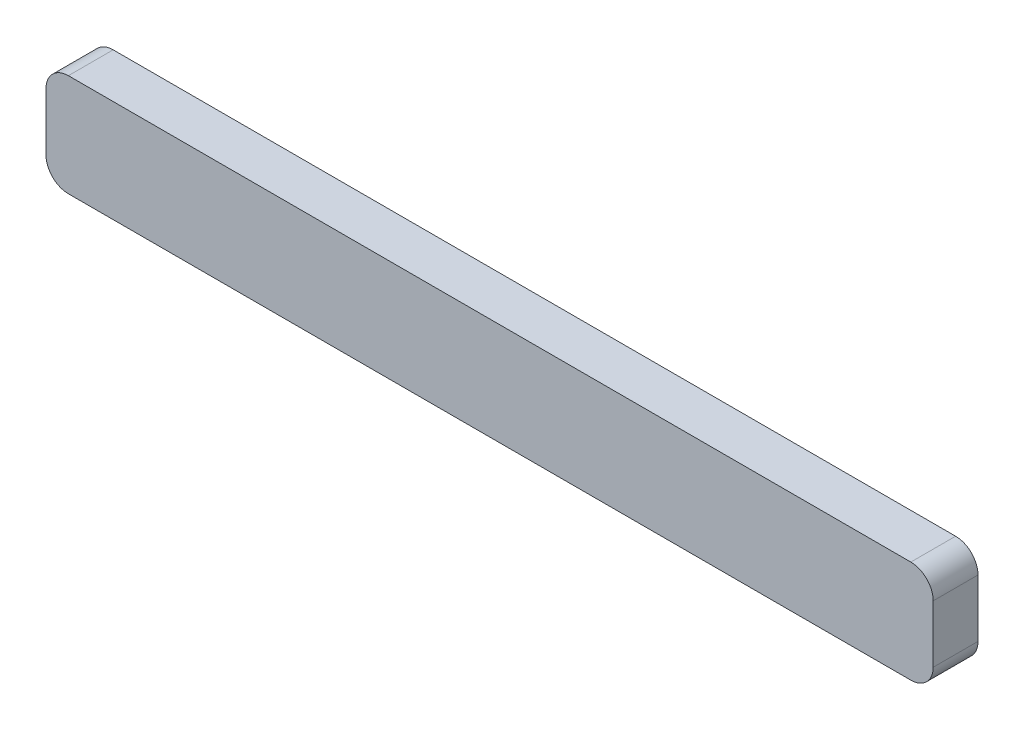
ISO-10303-21;
HEADER;
FILE_DESCRIPTION(('STEP AP214'),'2;1');
FILE_NAME('part.step','',(''),(''),'','','');
FILE_SCHEMA(('AUTOMOTIVE_DESIGN { 1 0 10303 214 1 1 1 1 }'));
ENDSEC;
DATA;
#1=APPLICATION_CONTEXT('core data for automotive mechanical design processes');
#2=APPLICATION_PROTOCOL_DEFINITION('international standard','automotive_design',2000,#1);
#3=PRODUCT_CONTEXT('',#1,'mechanical');
#4=PRODUCT('Part','Part','',(#3));
#5=PRODUCT_RELATED_PRODUCT_CATEGORY('part','',(#4));
#6=PRODUCT_DEFINITION_FORMATION('','',#4);
#7=PRODUCT_DEFINITION_CONTEXT('part definition',#1,'design');
#8=PRODUCT_DEFINITION('design','',#6,#7);
#9=PRODUCT_DEFINITION_SHAPE('','',#8);
#10=(LENGTH_UNIT() NAMED_UNIT(*) SI_UNIT(.MILLI.,.METRE.));
#11=(NAMED_UNIT(*) PLANE_ANGLE_UNIT() SI_UNIT($,.RADIAN.));
#12=(NAMED_UNIT(*) SI_UNIT($,.STERADIAN.) SOLID_ANGLE_UNIT());
#13=UNCERTAINTY_MEASURE_WITH_UNIT(LENGTH_MEASURE(1.E-05),#10,'distance_accuracy_value','');
#14=(GEOMETRIC_REPRESENTATION_CONTEXT(3) GLOBAL_UNCERTAINTY_ASSIGNED_CONTEXT((#13)) GLOBAL_UNIT_ASSIGNED_CONTEXT((#10,
#11,#12)) REPRESENTATION_CONTEXT('',''));
#15=CARTESIAN_POINT('',(0.,0.,0.));
#16=DIRECTION('',(0.,0.,1.));
#17=DIRECTION('',(1.,0.,0.));
#18=AXIS2_PLACEMENT_3D('',#15,#16,#17);
#19=CARTESIAN_POINT('',(-0.645559794709651,1.78285966548645,0.));
#20=DIRECTION('',(0.,0.,1.));
#21=DIRECTION('',(-0.707106781186548,0.707106781186548,0.));
#22=AXIS2_PLACEMENT_3D('',#19,#20,#21);
#23=CYLINDRICAL_SURFACE('',#22,0.05);
#24=CARTESIAN_POINT('',(-0.645559794709651,1.78285966548645,0.1));
#25=DIRECTION('',(0.,0.,-1.));
#26=DIRECTION('',(-1.,0.,0.));
#27=AXIS2_PLACEMENT_3D('',#24,#25,#26);
#28=CIRCLE('',#27,0.05);
#29=CARTESIAN_POINT('',(-0.695559794709651,1.78285966548645,0.1));
#30=VERTEX_POINT('',#29);
#31=CARTESIAN_POINT('',(-0.645559794709651,1.83285966548645,0.1));
#32=VERTEX_POINT('',#31);
#33=EDGE_CURVE('E11',#30,#32,#28,.T.);
#34=ORIENTED_EDGE('',*,*,#33,.T.);
#35=DIRECTION('',(0.,0.,-1.));
#36=VECTOR('',#35,1.);
#37=CARTESIAN_POINT('',(-0.645559794709651,1.83285966548645,0.1));
#38=LINE('',#37,#36);
#39=CARTESIAN_POINT('',(-0.645559794709651,1.83285966548645,0.));
#40=VERTEX_POINT('',#39);
#41=EDGE_CURVE('E145',#32,#40,#38,.T.);
#42=ORIENTED_EDGE('',*,*,#41,.T.);
#43=CARTESIAN_POINT('',(-0.645559794709651,1.78285966548645,0.));
#44=DIRECTION('',(0.,0.,1.));
#45=DIRECTION('',(0.,1.,0.));
#46=AXIS2_PLACEMENT_3D('',#43,#44,#45);
#47=CIRCLE('',#46,0.05);
#48=CARTESIAN_POINT('',(-0.695559794709651,1.78285966548645,0.));
#49=VERTEX_POINT('',#48);
#50=EDGE_CURVE('E143',#40,#49,#47,.T.);
#51=ORIENTED_EDGE('',*,*,#50,.T.);
#52=DIRECTION('',(0.,0.,1.));
#53=VECTOR('',#52,1.);
#54=CARTESIAN_POINT('',(-0.695559794709651,1.78285966548645,0.));
#55=LINE('',#54,#53);
#56=EDGE_CURVE('E24',#49,#30,#55,.T.);
#57=ORIENTED_EDGE('',*,*,#56,.T.);
#58=EDGE_LOOP('',(#34,#42,#51,#57));
#59=FACE_BOUND('',#58,.T.);
#60=ADVANCED_FACE('F17',(#59),#23,.T.);
#61=CARTESIAN_POINT('',(-0.695559794709651,1.83285966548645,0.));
#62=DIRECTION('',(-1.,0.,0.));
#63=DIRECTION('',(0.,-1.,0.));
#64=AXIS2_PLACEMENT_3D('',#61,#62,#63);
#65=PLANE('',#64);
#66=ORIENTED_EDGE('',*,*,#56,.F.);
#67=DIRECTION('',(0.,1.,0.));
#68=VECTOR('',#67,1.);
#69=CARTESIAN_POINT('',(-0.695559794709651,1.65443157862083,0.));
#70=LINE('',#69,#68);
#71=CARTESIAN_POINT('',(-0.695559794709651,1.65443157862083,0.));
#72=VERTEX_POINT('',#71);
#73=EDGE_CURVE('E140',#72,#49,#70,.T.);
#74=ORIENTED_EDGE('',*,*,#73,.F.);
#75=DIRECTION('',(0.,0.,-1.));
#76=VECTOR('',#75,1.);
#77=CARTESIAN_POINT('',(-0.695559794709651,1.65443157862083,0.1));
#78=LINE('',#77,#76);
#79=CARTESIAN_POINT('',(-0.695559794709651,1.65443157862083,0.1));
#80=VERTEX_POINT('',#79);
#81=EDGE_CURVE('E133',#80,#72,#78,.T.);
#82=ORIENTED_EDGE('',*,*,#81,.F.);
#83=DIRECTION('',(0.,-1.,0.));
#84=VECTOR('',#83,1.);
#85=CARTESIAN_POINT('',(-0.695559794709651,1.78285966548645,0.1));
#86=LINE('',#85,#84);
#87=EDGE_CURVE('E125',#30,#80,#86,.T.);
#88=ORIENTED_EDGE('',*,*,#87,.F.);
#89=EDGE_LOOP('',(#66,#74,#82,#88));
#90=FACE_BOUND('',#89,.T.);
#91=ADVANCED_FACE('F148',(#90),#65,.T.);
#92=CARTESIAN_POINT('',(0.294995501272643,1.71864562205364,0.));
#93=DIRECTION('',(0.,0.,1.));
#94=DIRECTION('',(1.,0.,0.));
#95=AXIS2_PLACEMENT_3D('',#92,#93,#94);
#96=PLANE('',#95);
#97=ORIENTED_EDGE('',*,*,#50,.F.);
#98=DIRECTION('',(1.,0.,0.));
#99=VECTOR('',#98,1.);
#100=CARTESIAN_POINT('',(-0.645559794709651,1.83285966548645,0.));
#101=LINE('',#100,#99);
#102=CARTESIAN_POINT('',(1.23555079725494,1.83285966548645,0.));
#103=VERTEX_POINT('',#102);
#104=EDGE_CURVE('E136',#40,#103,#101,.T.);
#105=ORIENTED_EDGE('',*,*,#104,.T.);
#106=CARTESIAN_POINT('',(1.23555079725494,1.78285966548645,0.));
#107=DIRECTION('',(0.,0.,1.));
#108=DIRECTION('',(1.,0.,0.));
#109=AXIS2_PLACEMENT_3D('',#106,#107,#108);
#110=CIRCLE('',#109,0.05);
#111=CARTESIAN_POINT('',(1.28555079725494,1.78285966548645,0.));
#112=VERTEX_POINT('',#111);
#113=EDGE_CURVE('E128',#112,#103,#110,.T.);
#114=ORIENTED_EDGE('',*,*,#113,.F.);
#115=DIRECTION('',(0.,-1.,0.));
#116=VECTOR('',#115,1.);
#117=CARTESIAN_POINT('',(1.28555079725494,1.78285966548645,0.));
#118=LINE('',#117,#116);
#119=CARTESIAN_POINT('',(1.28555079725494,1.65443157862083,0.));
#120=VERTEX_POINT('',#119);
#121=EDGE_CURVE('E115',#112,#120,#118,.T.);
#122=ORIENTED_EDGE('',*,*,#121,.T.);
#123=CARTESIAN_POINT('',(1.23555079725494,1.65443157862083,0.));
#124=DIRECTION('',(0.,0.,1.));
#125=DIRECTION('',(0.,-1.,0.));
#126=AXIS2_PLACEMENT_3D('',#123,#124,#125);
#127=CIRCLE('',#126,0.05);
#128=CARTESIAN_POINT('',(1.23555079725494,1.60443157862083,0.));
#129=VERTEX_POINT('',#128);
#130=EDGE_CURVE('E99',#129,#120,#127,.T.);
#131=ORIENTED_EDGE('',*,*,#130,.F.);
#132=DIRECTION('',(-1.,0.,0.));
#133=VECTOR('',#132,1.);
#134=CARTESIAN_POINT('',(1.23555079725494,1.60443157862083,0.));
#135=LINE('',#134,#133);
#136=CARTESIAN_POINT('',(-0.645559794709651,1.60443157862083,0.));
#137=VERTEX_POINT('',#136);
#138=EDGE_CURVE('E120',#129,#137,#135,.T.);
#139=ORIENTED_EDGE('',*,*,#138,.T.);
#140=CARTESIAN_POINT('',(-0.645559794709651,1.65443157862083,0.));
#141=DIRECTION('',(0.,0.,1.));
#142=DIRECTION('',(-1.,0.,0.));
#143=AXIS2_PLACEMENT_3D('',#140,#141,#142);
#144=CIRCLE('',#143,0.05);
#145=EDGE_CURVE('E117',#72,#137,#144,.T.);
#146=ORIENTED_EDGE('',*,*,#145,.F.);
#147=ORIENTED_EDGE('',*,*,#73,.T.);
#148=EDGE_LOOP('',(#97,#105,#114,#122,#131,#139,#146,#147));
#149=FACE_BOUND('',#148,.T.);
#150=ADVANCED_FACE('F158',(#149),#96,.F.);
#151=CARTESIAN_POINT('',(-0.645559794709651,1.65443157862083,0.));
#152=DIRECTION('',(0.,0.,1.));
#153=DIRECTION('',(-0.707106781186548,-0.707106781186548,0.));
#154=AXIS2_PLACEMENT_3D('',#151,#152,#153);
#155=CYLINDRICAL_SURFACE('',#154,0.05);
#156=CARTESIAN_POINT('',(-0.645559794709651,1.65443157862083,0.1));
#157=DIRECTION('',(0.,0.,-1.));
#158=DIRECTION('',(0.,-1.,0.));
#159=AXIS2_PLACEMENT_3D('',#156,#157,#158);
#160=CIRCLE('',#159,0.05);
#161=CARTESIAN_POINT('',(-0.645559794709651,1.60443157862083,0.1));
#162=VERTEX_POINT('',#161);
#163=EDGE_CURVE('E138',#162,#80,#160,.T.);
#164=ORIENTED_EDGE('',*,*,#163,.T.);
#165=ORIENTED_EDGE('',*,*,#81,.T.);
#166=ORIENTED_EDGE('',*,*,#145,.T.);
#167=DIRECTION('',(0.,0.,1.));
#168=VECTOR('',#167,1.);
#169=CARTESIAN_POINT('',(-0.645559794709651,1.60443157862083,0.));
#170=LINE('',#169,#168);
#171=EDGE_CURVE('E131',#137,#162,#170,.T.);
#172=ORIENTED_EDGE('',*,*,#171,.T.);
#173=EDGE_LOOP('',(#164,#165,#166,#172));
#174=FACE_BOUND('',#173,.T.);
#175=ADVANCED_FACE('F161',(#174),#155,.T.);
#176=CARTESIAN_POINT('',(-0.695559794709651,1.60443157862083,0.));
#177=DIRECTION('',(0.,-1.,0.));
#178=DIRECTION('',(1.,0.,0.));
#179=AXIS2_PLACEMENT_3D('',#176,#177,#178);
#180=PLANE('',#179);
#181=ORIENTED_EDGE('',*,*,#171,.F.);
#182=ORIENTED_EDGE('',*,*,#138,.F.);
#183=DIRECTION('',(0.,0.,-1.));
#184=VECTOR('',#183,1.);
#185=CARTESIAN_POINT('',(1.23555079725494,1.60443157862083,0.1));
#186=LINE('',#185,#184);
#187=CARTESIAN_POINT('',(1.23555079725494,1.60443157862083,0.1));
#188=VERTEX_POINT('',#187);
#189=EDGE_CURVE('E107',#188,#129,#186,.T.);
#190=ORIENTED_EDGE('',*,*,#189,.F.);
#191=DIRECTION('',(1.,0.,0.));
#192=VECTOR('',#191,1.);
#193=CARTESIAN_POINT('',(-0.645559794709651,1.60443157862083,0.1));
#194=LINE('',#193,#192);
#195=EDGE_CURVE('E104',#162,#188,#194,.T.);
#196=ORIENTED_EDGE('',*,*,#195,.F.);
#197=EDGE_LOOP('',(#181,#182,#190,#196));
#198=FACE_BOUND('',#197,.T.);
#199=ADVANCED_FACE('F163',(#198),#180,.T.);
#200=CARTESIAN_POINT('',(1.23555079725494,1.78285966548645,0.));
#201=DIRECTION('',(0.,0.,1.));
#202=DIRECTION('',(0.707106781186548,0.707106781186548,0.));
#203=AXIS2_PLACEMENT_3D('',#200,#201,#202);
#204=CYLINDRICAL_SURFACE('',#203,0.05);
#205=CARTESIAN_POINT('',(1.23555079725494,1.78285966548645,0.1));
#206=DIRECTION('',(0.,0.,-1.));
#207=DIRECTION('',(0.,1.,0.));
#208=AXIS2_PLACEMENT_3D('',#205,#206,#207);
#209=CIRCLE('',#208,0.05);
#210=CARTESIAN_POINT('',(1.23555079725494,1.83285966548645,0.1));
#211=VERTEX_POINT('',#210);
#212=CARTESIAN_POINT('',(1.28555079725494,1.78285966548645,0.1));
#213=VERTEX_POINT('',#212);
#214=EDGE_CURVE('E123',#211,#213,#209,.T.);
#215=ORIENTED_EDGE('',*,*,#214,.T.);
#216=DIRECTION('',(0.,0.,-1.));
#217=VECTOR('',#216,1.);
#218=CARTESIAN_POINT('',(1.28555079725494,1.78285966548645,0.1));
#219=LINE('',#218,#217);
#220=EDGE_CURVE('E85',#213,#112,#219,.T.);
#221=ORIENTED_EDGE('',*,*,#220,.T.);
#222=ORIENTED_EDGE('',*,*,#113,.T.);
#223=DIRECTION('',(0.,0.,1.));
#224=VECTOR('',#223,1.);
#225=CARTESIAN_POINT('',(1.23555079725494,1.83285966548645,0.));
#226=LINE('',#225,#224);
#227=EDGE_CURVE('E89',#103,#211,#226,.T.);
#228=ORIENTED_EDGE('',*,*,#227,.T.);
#229=EDGE_LOOP('',(#215,#221,#222,#228));
#230=FACE_BOUND('',#229,.T.);
#231=ADVANCED_FACE('F155',(#230),#204,.T.);
#232=CARTESIAN_POINT('',(1.28555079725494,1.83285966548645,0.));
#233=DIRECTION('',(0.,1.,0.));
#234=DIRECTION('',(-1.,0.,0.));
#235=AXIS2_PLACEMENT_3D('',#232,#233,#234);
#236=PLANE('',#235);
#237=ORIENTED_EDGE('',*,*,#41,.F.);
#238=DIRECTION('',(-1.,0.,0.));
#239=VECTOR('',#238,1.);
#240=CARTESIAN_POINT('',(1.23555079725494,1.83285966548645,0.1));
#241=LINE('',#240,#239);
#242=EDGE_CURVE('E105',#211,#32,#241,.T.);
#243=ORIENTED_EDGE('',*,*,#242,.F.);
#244=ORIENTED_EDGE('',*,*,#227,.F.);
#245=ORIENTED_EDGE('',*,*,#104,.F.);
#246=EDGE_LOOP('',(#237,#243,#244,#245));
#247=FACE_BOUND('',#246,.T.);
#248=ADVANCED_FACE('F152',(#247),#236,.T.);
#249=CARTESIAN_POINT('',(1.23555079725494,1.65443157862083,0.));
#250=DIRECTION('',(0.,0.,1.));
#251=DIRECTION('',(0.707106781186548,-0.707106781186548,0.));
#252=AXIS2_PLACEMENT_3D('',#249,#250,#251);
#253=CYLINDRICAL_SURFACE('',#252,0.05);
#254=CARTESIAN_POINT('',(1.23555079725494,1.65443157862083,0.1));
#255=DIRECTION('',(0.,0.,-1.));
#256=DIRECTION('',(1.,0.,0.));
#257=AXIS2_PLACEMENT_3D('',#254,#255,#256);
#258=CIRCLE('',#257,0.05);
#259=CARTESIAN_POINT('',(1.28555079725494,1.65443157862083,0.1));
#260=VERTEX_POINT('',#259);
#261=EDGE_CURVE('E96',#260,#188,#258,.T.);
#262=ORIENTED_EDGE('',*,*,#261,.T.);
#263=ORIENTED_EDGE('',*,*,#189,.T.);
#264=ORIENTED_EDGE('',*,*,#130,.T.);
#265=DIRECTION('',(0.,0.,1.));
#266=VECTOR('',#265,1.);
#267=CARTESIAN_POINT('',(1.28555079725494,1.65443157862083,0.));
#268=LINE('',#267,#266);
#269=EDGE_CURVE('E83',#120,#260,#268,.T.);
#270=ORIENTED_EDGE('',*,*,#269,.T.);
#271=EDGE_LOOP('',(#262,#263,#264,#270));
#272=FACE_BOUND('',#271,.T.);
#273=ADVANCED_FACE('F94',(#272),#253,.T.);
#274=CARTESIAN_POINT('',(1.28555079725494,1.60443157862083,0.));
#275=DIRECTION('',(1.,0.,0.));
#276=DIRECTION('',(0.,1.,0.));
#277=AXIS2_PLACEMENT_3D('',#274,#275,#276);
#278=PLANE('',#277);
#279=ORIENTED_EDGE('',*,*,#220,.F.);
#280=DIRECTION('',(0.,1.,0.));
#281=VECTOR('',#280,1.);
#282=CARTESIAN_POINT('',(1.28555079725494,1.65443157862083,0.1));
#283=LINE('',#282,#281);
#284=EDGE_CURVE('E79',#260,#213,#283,.T.);
#285=ORIENTED_EDGE('',*,*,#284,.F.);
#286=ORIENTED_EDGE('',*,*,#269,.F.);
#287=ORIENTED_EDGE('',*,*,#121,.F.);
#288=EDGE_LOOP('',(#279,#285,#286,#287));
#289=FACE_BOUND('',#288,.T.);
#290=ADVANCED_FACE('F81',(#289),#278,.T.);
#291=CARTESIAN_POINT('',(0.294995501272644,1.71864562205364,0.1));
#292=DIRECTION('',(0.,0.,1.));
#293=DIRECTION('',(1.,0.,0.));
#294=AXIS2_PLACEMENT_3D('',#291,#292,#293);
#295=PLANE('',#294);
#296=ORIENTED_EDGE('',*,*,#33,.F.);
#297=ORIENTED_EDGE('',*,*,#87,.T.);
#298=ORIENTED_EDGE('',*,*,#163,.F.);
#299=ORIENTED_EDGE('',*,*,#195,.T.);
#300=ORIENTED_EDGE('',*,*,#261,.F.);
#301=ORIENTED_EDGE('',*,*,#284,.T.);
#302=ORIENTED_EDGE('',*,*,#214,.F.);
#303=ORIENTED_EDGE('',*,*,#242,.T.);
#304=EDGE_LOOP('',(#296,#297,#298,#299,#300,#301,#302,#303));
#305=FACE_BOUND('',#304,.T.);
#306=ADVANCED_FACE('F101',(#305),#295,.T.);
#307=CLOSED_SHELL('',(#60,#91,#150,#175,#199,#231,#248,#273,#290,#306));
#308=MANIFOLD_SOLID_BREP('B1',#307);
#309=ADVANCED_BREP_SHAPE_REPRESENTATION('',(#18,#308),#14);
#310=SHAPE_DEFINITION_REPRESENTATION(#9,#309);
ENDSEC;
END-ISO-10303-21;
